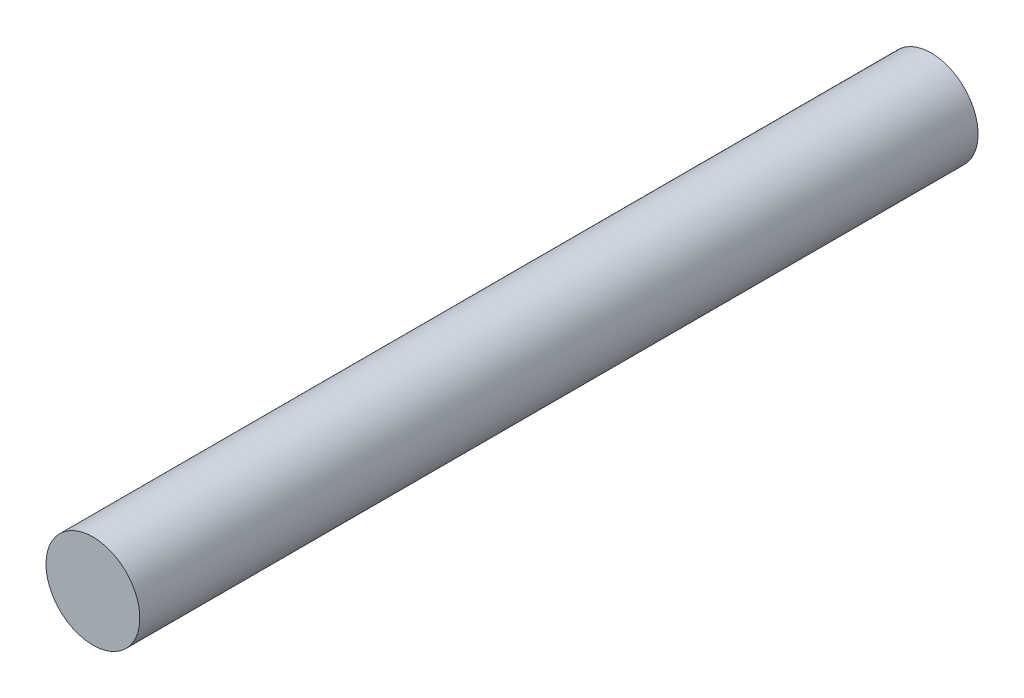
ISO-10303-21;
HEADER;
FILE_DESCRIPTION(('STEP AP214'),'2;1');
FILE_NAME('part.step','',(''),(''),'','','');
FILE_SCHEMA(('AUTOMOTIVE_DESIGN { 1 0 10303 214 1 1 1 1 }'));
ENDSEC;
DATA;
#1=APPLICATION_CONTEXT('core data for automotive mechanical design processes');
#2=APPLICATION_PROTOCOL_DEFINITION('international standard','automotive_design',2000,#1);
#3=PRODUCT_CONTEXT('',#1,'mechanical');
#4=PRODUCT('Part','Part','',(#3));
#5=PRODUCT_RELATED_PRODUCT_CATEGORY('part','',(#4));
#6=PRODUCT_DEFINITION_FORMATION('','',#4);
#7=PRODUCT_DEFINITION_CONTEXT('part definition',#1,'design');
#8=PRODUCT_DEFINITION('design','',#6,#7);
#9=PRODUCT_DEFINITION_SHAPE('','',#8);
#10=(LENGTH_UNIT() NAMED_UNIT(*) SI_UNIT(.MILLI.,.METRE.));
#11=(NAMED_UNIT(*) PLANE_ANGLE_UNIT() SI_UNIT($,.RADIAN.));
#12=(NAMED_UNIT(*) SI_UNIT($,.STERADIAN.) SOLID_ANGLE_UNIT());
#13=UNCERTAINTY_MEASURE_WITH_UNIT(LENGTH_MEASURE(1.E-05),#10,'distance_accuracy_value','');
#14=(GEOMETRIC_REPRESENTATION_CONTEXT(3) GLOBAL_UNCERTAINTY_ASSIGNED_CONTEXT((#13)) GLOBAL_UNIT_ASSIGNED_CONTEXT((#10,
#11,#12)) REPRESENTATION_CONTEXT('',''));
#15=CARTESIAN_POINT('',(0.,0.,0.));
#16=DIRECTION('',(0.,0.,1.));
#17=DIRECTION('',(1.,0.,0.));
#18=AXIS2_PLACEMENT_3D('',#15,#16,#17);
#19=CARTESIAN_POINT('',(0.15,0.,0.));
#20=DIRECTION('',(0.,0.,-1.));
#21=DIRECTION('',(-1.,0.,0.));
#22=AXIS2_PLACEMENT_3D('',#19,#20,#21);
#23=PLANE('',#22);
#24=CARTESIAN_POINT('',(0.,0.,0.));
#25=DIRECTION('',(0.,0.,-1.));
#26=DIRECTION('',(-1.,0.,0.));
#27=AXIS2_PLACEMENT_3D('',#24,#25,#26);
#28=CIRCLE('',#27,0.15);
#29=CARTESIAN_POINT('',(-0.15,0.,0.));
#30=VERTEX_POINT('',#29);
#31=EDGE_CURVE('E17',#30,#30,#28,.F.);
#32=ORIENTED_EDGE('',*,*,#31,.F.);
#33=EDGE_LOOP('',(#32));
#34=FACE_BOUND('',#33,.T.);
#35=ADVANCED_FACE('F14',(#34),#23,.T.);
#36=CARTESIAN_POINT('',(0.15,0.,2.68));
#37=DIRECTION('',(0.,0.,-1.));
#38=DIRECTION('',(-1.,0.,0.));
#39=AXIS2_PLACEMENT_3D('',#36,#37,#38);
#40=PLANE('',#39);
#41=CARTESIAN_POINT('',(0.,0.,2.68));
#42=DIRECTION('',(0.,0.,-1.));
#43=DIRECTION('',(-1.,0.,0.));
#44=AXIS2_PLACEMENT_3D('',#41,#42,#43);
#45=CIRCLE('',#44,0.15);
#46=CARTESIAN_POINT('',(-0.15,0.,2.68));
#47=VERTEX_POINT('',#46);
#48=EDGE_CURVE('E10',#47,#47,#45,.T.);
#49=ORIENTED_EDGE('',*,*,#48,.F.);
#50=EDGE_LOOP('',(#49));
#51=FACE_BOUND('',#50,.T.);
#52=ADVANCED_FACE('F35',(#51),#40,.F.);
#53=CARTESIAN_POINT('',(0.,0.,0.));
#54=DIRECTION('',(0.,0.,-1.));
#55=DIRECTION('',(-1.,0.,0.));
#56=AXIS2_PLACEMENT_3D('',#53,#54,#55);
#57=CYLINDRICAL_SURFACE('',#56,0.15);
#58=ORIENTED_EDGE('',*,*,#31,.T.);
#59=EDGE_LOOP('',(#58));
#60=FACE_BOUND('',#59,.T.);
#61=ORIENTED_EDGE('',*,*,#48,.T.);
#62=EDGE_LOOP('',(#61));
#63=FACE_BOUND('',#62,.T.);
#64=ADVANCED_FACE('F32',(#60,#63),#57,.T.);
#65=CLOSED_SHELL('',(#35,#52,#64));
#66=MANIFOLD_SOLID_BREP('B1',#65);
#67=ADVANCED_BREP_SHAPE_REPRESENTATION('',(#18,#66),#14);
#68=SHAPE_DEFINITION_REPRESENTATION(#9,#67);
ENDSEC;
END-ISO-10303-21;
